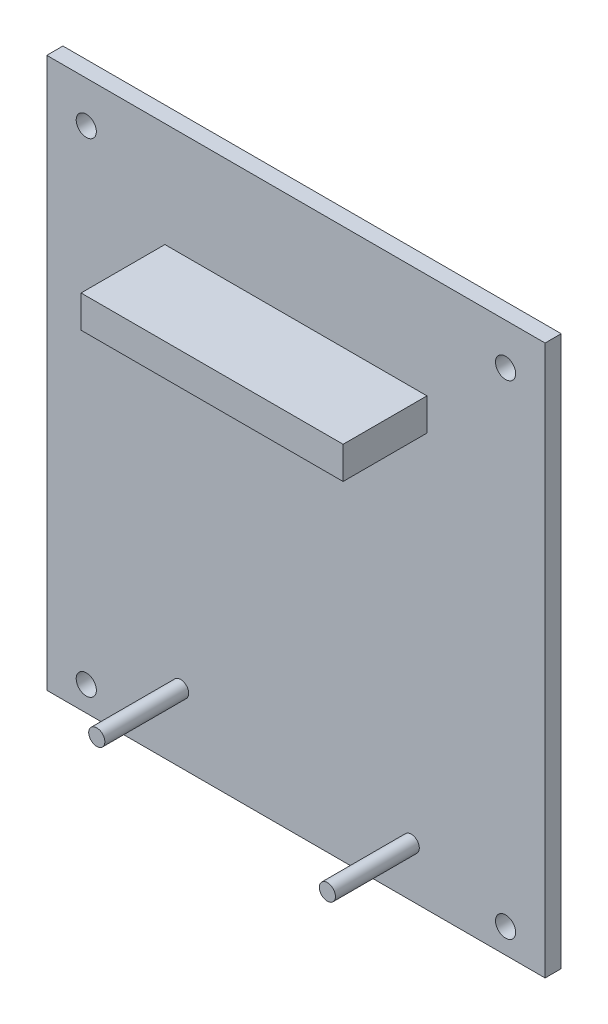
ISO-10303-21;
HEADER;
FILE_DESCRIPTION(('STEP AP214'),'2;1');
FILE_NAME('part.step','',(''),(''),'','','');
FILE_SCHEMA(('AUTOMOTIVE_DESIGN { 1 0 10303 214 1 1 1 1 }'));
ENDSEC;
DATA;
#1=APPLICATION_CONTEXT('core data for automotive mechanical design processes');
#2=APPLICATION_PROTOCOL_DEFINITION('international standard','automotive_design',2000,#1);
#3=PRODUCT_CONTEXT('',#1,'mechanical');
#4=PRODUCT('Part','Part','',(#3));
#5=PRODUCT_RELATED_PRODUCT_CATEGORY('part','',(#4));
#6=PRODUCT_DEFINITION_FORMATION('','',#4);
#7=PRODUCT_DEFINITION_CONTEXT('part definition',#1,'design');
#8=PRODUCT_DEFINITION('design','',#6,#7);
#9=PRODUCT_DEFINITION_SHAPE('','',#8);
#10=(LENGTH_UNIT() NAMED_UNIT(*) SI_UNIT(.MILLI.,.METRE.));
#11=(NAMED_UNIT(*) PLANE_ANGLE_UNIT() SI_UNIT($,.RADIAN.));
#12=(NAMED_UNIT(*) SI_UNIT($,.STERADIAN.) SOLID_ANGLE_UNIT());
#13=UNCERTAINTY_MEASURE_WITH_UNIT(LENGTH_MEASURE(1.E-05),#10,'distance_accuracy_value','');
#14=(GEOMETRIC_REPRESENTATION_CONTEXT(3) GLOBAL_UNCERTAINTY_ASSIGNED_CONTEXT((#13)) GLOBAL_UNIT_ASSIGNED_CONTEXT((#10,
#11,#12)) REPRESENTATION_CONTEXT('',''));
#15=CARTESIAN_POINT('',(0.,0.,0.));
#16=DIRECTION('',(0.,0.,1.));
#17=DIRECTION('',(1.,0.,0.));
#18=AXIS2_PLACEMENT_3D('',#15,#16,#17);
#19=CARTESIAN_POINT('',(0.,0.,2.54));
#20=DIRECTION('',(0.,0.,1.));
#21=DIRECTION('',(1.,0.,0.));
#22=AXIS2_PLACEMENT_3D('',#19,#20,#21);
#23=PLANE('',#22);
#24=CARTESIAN_POINT('',(57.404,7.8105,2.54));
#25=DIRECTION('',(0.,0.,1.));
#26=DIRECTION('',(1.,0.,0.));
#27=AXIS2_PLACEMENT_3D('',#24,#25,#26);
#28=CIRCLE('',#27,1.27);
#29=CARTESIAN_POINT('',(58.674,7.8105,2.54));
#30=VERTEX_POINT('',#29);
#31=EDGE_CURVE('E259',#30,#30,#28,.T.);
#32=ORIENTED_EDGE('',*,*,#31,.F.);
#33=EDGE_LOOP('',(#32));
#34=FACE_BOUND('',#33,.T.);
#35=CARTESIAN_POINT('',(21.082,10.7569,2.54));
#36=DIRECTION('',(0.,0.,1.));
#37=DIRECTION('',(1.,0.,0.));
#38=AXIS2_PLACEMENT_3D('',#35,#36,#37);
#39=CIRCLE('',#38,1.27);
#40=CARTESIAN_POINT('',(22.352,10.7569,2.54));
#41=VERTEX_POINT('',#40);
#42=EDGE_CURVE('E258',#41,#41,#39,.T.);
#43=ORIENTED_EDGE('',*,*,#42,.F.);
#44=EDGE_LOOP('',(#43));
#45=FACE_BOUND('',#44,.T.);
#46=CARTESIAN_POINT('',(72.263,3.91160000000003,2.54));
#47=DIRECTION('',(0.,0.,1.));
#48=DIRECTION('',(1.,0.,0.));
#49=AXIS2_PLACEMENT_3D('',#46,#47,#48);
#50=CIRCLE('',#49,1.58749999999999);
#51=CARTESIAN_POINT('',(73.8505,3.91160000000003,2.54));
#52=VERTEX_POINT('',#51);
#53=EDGE_CURVE('E142',#52,#52,#50,.T.);
#54=ORIENTED_EDGE('',*,*,#53,.F.);
#55=EDGE_LOOP('',(#54));
#56=FACE_BOUND('',#55,.T.);
#57=CARTESIAN_POINT('',(6.22299999999995,80.1116,2.54));
#58=DIRECTION('',(0.,0.,1.));
#59=DIRECTION('',(1.,0.,0.));
#60=AXIS2_PLACEMENT_3D('',#57,#58,#59);
#61=CIRCLE('',#60,1.58749999999999);
#62=CARTESIAN_POINT('',(7.81049999999995,80.1116,2.54));
#63=VERTEX_POINT('',#62);
#64=EDGE_CURVE('E154',#63,#63,#61,.T.);
#65=ORIENTED_EDGE('',*,*,#64,.F.);
#66=EDGE_LOOP('',(#65));
#67=FACE_BOUND('',#66,.T.);
#68=DIRECTION('',(0.,-1.,0.));
#69=VECTOR('',#68,1.);
#70=CARTESIAN_POINT('',(0.,86.614,2.54));
#71=LINE('',#70,#69);
#72=CARTESIAN_POINT('',(0.,86.614,2.54));
#73=VERTEX_POINT('',#72);
#74=CARTESIAN_POINT('',(0.,0.,2.54));
#75=VERTEX_POINT('',#74);
#76=EDGE_CURVE('E160',#73,#75,#71,.T.);
#77=ORIENTED_EDGE('',*,*,#76,.T.);
#78=DIRECTION('',(1.,0.,0.));
#79=VECTOR('',#78,1.);
#80=CARTESIAN_POINT('',(0.,0.,2.54));
#81=LINE('',#80,#79);
#82=CARTESIAN_POINT('',(78.486,0.,2.54));
#83=VERTEX_POINT('',#82);
#84=EDGE_CURVE('E84',#75,#83,#81,.T.);
#85=ORIENTED_EDGE('',*,*,#84,.T.);
#86=DIRECTION('',(0.,1.,0.));
#87=VECTOR('',#86,1.);
#88=CARTESIAN_POINT('',(78.486,86.614,2.54));
#89=LINE('',#88,#87);
#90=CARTESIAN_POINT('',(78.486,86.614,2.54));
#91=VERTEX_POINT('',#90);
#92=EDGE_CURVE('E163',#83,#91,#89,.T.);
#93=ORIENTED_EDGE('',*,*,#92,.T.);
#94=DIRECTION('',(-1.,0.,0.));
#95=VECTOR('',#94,1.);
#96=CARTESIAN_POINT('',(0.,86.614,2.54));
#97=LINE('',#96,#95);
#98=EDGE_CURVE('E56',#91,#73,#97,.T.);
#99=ORIENTED_EDGE('',*,*,#98,.T.);
#100=EDGE_LOOP('',(#77,#85,#93,#99));
#101=FACE_BOUND('',#100,.T.);
#102=CARTESIAN_POINT('',(72.2629999999999,80.1116,2.54));
#103=DIRECTION('',(0.,0.,1.));
#104=DIRECTION('',(1.,0.,0.));
#105=AXIS2_PLACEMENT_3D('',#102,#103,#104);
#106=CIRCLE('',#105,1.5875);
#107=CARTESIAN_POINT('',(73.8505,80.1116,2.54));
#108=VERTEX_POINT('',#107);
#109=EDGE_CURVE('E148',#108,#108,#106,.T.);
#110=ORIENTED_EDGE('',*,*,#109,.F.);
#111=EDGE_LOOP('',(#110));
#112=FACE_BOUND('',#111,.T.);
#113=CARTESIAN_POINT('',(6.223,3.91159999999997,2.54));
#114=DIRECTION('',(0.,0.,1.));
#115=DIRECTION('',(1.,0.,0.));
#116=AXIS2_PLACEMENT_3D('',#113,#114,#115);
#117=CIRCLE('',#116,1.58749999999999);
#118=CARTESIAN_POINT('',(7.8105,3.91159999999997,2.54));
#119=VERTEX_POINT('',#118);
#120=EDGE_CURVE('E134',#119,#119,#117,.T.);
#121=ORIENTED_EDGE('',*,*,#120,.F.);
#122=EDGE_LOOP('',(#121));
#123=FACE_BOUND('',#122,.T.);
#124=DIRECTION('',(1.,0.,0.));
#125=VECTOR('',#124,1.);
#126=CARTESIAN_POINT('',(18.6055,65.0239999999999,2.54));
#127=LINE('',#126,#125);
#128=CARTESIAN_POINT('',(18.6055,65.0239999999999,2.54));
#129=VERTEX_POINT('',#128);
#130=CARTESIAN_POINT('',(59.8805,65.024,2.54));
#131=VERTEX_POINT('',#130);
#132=EDGE_CURVE('E273',#129,#131,#127,.T.);
#133=ORIENTED_EDGE('',*,*,#132,.F.);
#134=DIRECTION('',(0.,-1.,0.));
#135=VECTOR('',#134,1.);
#136=CARTESIAN_POINT('',(18.6055,70.104,2.54));
#137=LINE('',#136,#135);
#138=CARTESIAN_POINT('',(18.6055,70.104,2.54));
#139=VERTEX_POINT('',#138);
#140=EDGE_CURVE('E129',#139,#129,#137,.T.);
#141=ORIENTED_EDGE('',*,*,#140,.F.);
#142=DIRECTION('',(-1.,0.,0.));
#143=VECTOR('',#142,1.);
#144=CARTESIAN_POINT('',(18.6055,70.104,2.54));
#145=LINE('',#144,#143);
#146=CARTESIAN_POINT('',(59.8805,70.104,2.54));
#147=VERTEX_POINT('',#146);
#148=EDGE_CURVE('E125',#147,#139,#145,.T.);
#149=ORIENTED_EDGE('',*,*,#148,.F.);
#150=DIRECTION('',(0.,1.,0.));
#151=VECTOR('',#150,1.);
#152=CARTESIAN_POINT('',(59.8805,70.104,2.54));
#153=LINE('',#152,#151);
#154=EDGE_CURVE('E275',#131,#147,#153,.T.);
#155=ORIENTED_EDGE('',*,*,#154,.F.);
#156=EDGE_LOOP('',(#133,#141,#149,#155));
#157=FACE_BOUND('',#156,.T.);
#158=ADVANCED_FACE('F32',(#34,#45,#56,#67,#101,#112,#123,#157),#23,.T.);
#159=CARTESIAN_POINT('',(0.,0.,0.));
#160=DIRECTION('',(0.,0.,1.));
#161=DIRECTION('',(1.,0.,0.));
#162=AXIS2_PLACEMENT_3D('',#159,#160,#161);
#163=PLANE('',#162);
#164=DIRECTION('',(0.,-1.,0.));
#165=VECTOR('',#164,1.);
#166=CARTESIAN_POINT('',(0.,86.614,0.));
#167=LINE('',#166,#165);
#168=CARTESIAN_POINT('',(0.,86.614,0.));
#169=VERTEX_POINT('',#168);
#170=CARTESIAN_POINT('',(0.,0.,0.));
#171=VERTEX_POINT('',#170);
#172=EDGE_CURVE('E157',#169,#171,#167,.T.);
#173=ORIENTED_EDGE('',*,*,#172,.F.);
#174=DIRECTION('',(-1.,0.,0.));
#175=VECTOR('',#174,1.);
#176=CARTESIAN_POINT('',(0.,86.614,0.));
#177=LINE('',#176,#175);
#178=CARTESIAN_POINT('',(78.486,86.614,0.));
#179=VERTEX_POINT('',#178);
#180=EDGE_CURVE('E77',#179,#169,#177,.T.);
#181=ORIENTED_EDGE('',*,*,#180,.F.);
#182=DIRECTION('',(0.,1.,0.));
#183=VECTOR('',#182,1.);
#184=CARTESIAN_POINT('',(78.486,86.614,0.));
#185=LINE('',#184,#183);
#186=CARTESIAN_POINT('',(78.486,0.,0.));
#187=VERTEX_POINT('',#186);
#188=EDGE_CURVE('E171',#187,#179,#185,.T.);
#189=ORIENTED_EDGE('',*,*,#188,.F.);
#190=DIRECTION('',(1.,0.,0.));
#191=VECTOR('',#190,1.);
#192=CARTESIAN_POINT('',(0.,0.,0.));
#193=LINE('',#192,#191);
#194=EDGE_CURVE('E169',#171,#187,#193,.T.);
#195=ORIENTED_EDGE('',*,*,#194,.F.);
#196=EDGE_LOOP('',(#173,#181,#189,#195));
#197=FACE_BOUND('',#196,.T.);
#198=CARTESIAN_POINT('',(6.22299999999995,80.1116,0.));
#199=DIRECTION('',(0.,0.,1.));
#200=DIRECTION('',(1.,0.,0.));
#201=AXIS2_PLACEMENT_3D('',#198,#199,#200);
#202=CIRCLE('',#201,1.58749999999999);
#203=CARTESIAN_POINT('',(7.81049999999995,80.1116,0.));
#204=VERTEX_POINT('',#203);
#205=EDGE_CURVE('E151',#204,#204,#202,.T.);
#206=ORIENTED_EDGE('',*,*,#205,.T.);
#207=EDGE_LOOP('',(#206));
#208=FACE_BOUND('',#207,.T.);
#209=CARTESIAN_POINT('',(72.2629999999999,80.1116,0.));
#210=DIRECTION('',(0.,0.,1.));
#211=DIRECTION('',(1.,0.,0.));
#212=AXIS2_PLACEMENT_3D('',#209,#210,#211);
#213=CIRCLE('',#212,1.5875);
#214=CARTESIAN_POINT('',(73.8505,80.1116,0.));
#215=VERTEX_POINT('',#214);
#216=EDGE_CURVE('E145',#215,#215,#213,.T.);
#217=ORIENTED_EDGE('',*,*,#216,.T.);
#218=EDGE_LOOP('',(#217));
#219=FACE_BOUND('',#218,.T.);
#220=CARTESIAN_POINT('',(72.263,3.91160000000003,0.));
#221=DIRECTION('',(0.,0.,1.));
#222=DIRECTION('',(1.,0.,0.));
#223=AXIS2_PLACEMENT_3D('',#220,#221,#222);
#224=CIRCLE('',#223,1.58749999999999);
#225=CARTESIAN_POINT('',(73.8505,3.91160000000003,0.));
#226=VERTEX_POINT('',#225);
#227=EDGE_CURVE('E140',#226,#226,#224,.T.);
#228=ORIENTED_EDGE('',*,*,#227,.T.);
#229=EDGE_LOOP('',(#228));
#230=FACE_BOUND('',#229,.T.);
#231=CARTESIAN_POINT('',(6.223,3.91159999999997,0.));
#232=DIRECTION('',(0.,0.,1.));
#233=DIRECTION('',(1.,0.,0.));
#234=AXIS2_PLACEMENT_3D('',#231,#232,#233);
#235=CIRCLE('',#234,1.58749999999999);
#236=CARTESIAN_POINT('',(7.8105,3.91159999999997,0.));
#237=VERTEX_POINT('',#236);
#238=EDGE_CURVE('E131',#237,#237,#235,.T.);
#239=ORIENTED_EDGE('',*,*,#238,.T.);
#240=EDGE_LOOP('',(#239));
#241=FACE_BOUND('',#240,.T.);
#242=ADVANCED_FACE('F184',(#197,#208,#219,#230,#241),#163,.F.);
#243=CARTESIAN_POINT('',(0.,86.614,2.54));
#244=DIRECTION('',(1.,0.,0.));
#245=DIRECTION('',(0.,1.,0.));
#246=AXIS2_PLACEMENT_3D('',#243,#244,#245);
#247=PLANE('',#246);
#248=ORIENTED_EDGE('',*,*,#172,.T.);
#249=DIRECTION('',(0.,0.,-1.));
#250=VECTOR('',#249,1.);
#251=CARTESIAN_POINT('',(0.,0.,2.54));
#252=LINE('',#251,#250);
#253=EDGE_CURVE('E11',#75,#171,#252,.T.);
#254=ORIENTED_EDGE('',*,*,#253,.F.);
#255=ORIENTED_EDGE('',*,*,#76,.F.);
#256=DIRECTION('',(0.,0.,-1.));
#257=VECTOR('',#256,1.);
#258=CARTESIAN_POINT('',(0.,86.614,2.54));
#259=LINE('',#258,#257);
#260=EDGE_CURVE('E166',#73,#169,#259,.T.);
#261=ORIENTED_EDGE('',*,*,#260,.T.);
#262=EDGE_LOOP('',(#248,#254,#255,#261));
#263=FACE_BOUND('',#262,.T.);
#264=ADVANCED_FACE('F34',(#263),#247,.F.);
#265=CARTESIAN_POINT('',(0.,0.,2.54));
#266=DIRECTION('',(0.,1.,0.));
#267=DIRECTION('',(-1.,0.,0.));
#268=AXIS2_PLACEMENT_3D('',#265,#266,#267);
#269=PLANE('',#268);
#270=ORIENTED_EDGE('',*,*,#194,.T.);
#271=DIRECTION('',(0.,0.,-1.));
#272=VECTOR('',#271,1.);
#273=CARTESIAN_POINT('',(78.486,0.,2.54));
#274=LINE('',#273,#272);
#275=EDGE_CURVE('E40',#83,#187,#274,.T.);
#276=ORIENTED_EDGE('',*,*,#275,.F.);
#277=ORIENTED_EDGE('',*,*,#84,.F.);
#278=ORIENTED_EDGE('',*,*,#253,.T.);
#279=EDGE_LOOP('',(#270,#276,#277,#278));
#280=FACE_BOUND('',#279,.T.);
#281=ADVANCED_FACE('F200',(#280),#269,.F.);
#282=CARTESIAN_POINT('',(78.486,86.614,2.54));
#283=DIRECTION('',(-1.,0.,0.));
#284=DIRECTION('',(0.,-1.,0.));
#285=AXIS2_PLACEMENT_3D('',#282,#283,#284);
#286=PLANE('',#285);
#287=ORIENTED_EDGE('',*,*,#188,.T.);
#288=DIRECTION('',(0.,0.,-1.));
#289=VECTOR('',#288,1.);
#290=CARTESIAN_POINT('',(78.486,86.614,2.54));
#291=LINE('',#290,#289);
#292=EDGE_CURVE('E175',#91,#179,#291,.T.);
#293=ORIENTED_EDGE('',*,*,#292,.F.);
#294=ORIENTED_EDGE('',*,*,#92,.F.);
#295=ORIENTED_EDGE('',*,*,#275,.T.);
#296=EDGE_LOOP('',(#287,#293,#294,#295));
#297=FACE_BOUND('',#296,.T.);
#298=ADVANCED_FACE('F180',(#297),#286,.F.);
#299=CARTESIAN_POINT('',(0.,86.614,2.54));
#300=DIRECTION('',(0.,-1.,0.));
#301=DIRECTION('',(1.,0.,0.));
#302=AXIS2_PLACEMENT_3D('',#299,#300,#301);
#303=PLANE('',#302);
#304=ORIENTED_EDGE('',*,*,#180,.T.);
#305=ORIENTED_EDGE('',*,*,#260,.F.);
#306=ORIENTED_EDGE('',*,*,#98,.F.);
#307=ORIENTED_EDGE('',*,*,#292,.T.);
#308=EDGE_LOOP('',(#304,#305,#306,#307));
#309=FACE_BOUND('',#308,.T.);
#310=ADVANCED_FACE('F189',(#309),#303,.F.);
#311=CARTESIAN_POINT('',(6.22299999999995,80.1116,2.54));
#312=DIRECTION('',(0.,0.,-1.));
#313=DIRECTION('',(-1.,0.,0.));
#314=AXIS2_PLACEMENT_3D('',#311,#312,#313);
#315=CYLINDRICAL_SURFACE('',#314,1.58749999999999);
#316=ORIENTED_EDGE('',*,*,#64,.T.);
#317=EDGE_LOOP('',(#316));
#318=FACE_BOUND('',#317,.T.);
#319=ORIENTED_EDGE('',*,*,#205,.F.);
#320=EDGE_LOOP('',(#319));
#321=FACE_BOUND('',#320,.T.);
#322=ADVANCED_FACE('F191',(#318,#321),#315,.F.);
#323=CARTESIAN_POINT('',(72.2629999999999,80.1116,2.54));
#324=DIRECTION('',(0.,0.,-1.));
#325=DIRECTION('',(-1.,0.,0.));
#326=AXIS2_PLACEMENT_3D('',#323,#324,#325);
#327=CYLINDRICAL_SURFACE('',#326,1.5875);
#328=ORIENTED_EDGE('',*,*,#109,.T.);
#329=EDGE_LOOP('',(#328));
#330=FACE_BOUND('',#329,.T.);
#331=ORIENTED_EDGE('',*,*,#216,.F.);
#332=EDGE_LOOP('',(#331));
#333=FACE_BOUND('',#332,.T.);
#334=ADVANCED_FACE('F197',(#330,#333),#327,.F.);
#335=CARTESIAN_POINT('',(72.263,3.91160000000003,2.54));
#336=DIRECTION('',(0.,0.,-1.));
#337=DIRECTION('',(-1.,0.,0.));
#338=AXIS2_PLACEMENT_3D('',#335,#336,#337);
#339=CYLINDRICAL_SURFACE('',#338,1.58749999999999);
#340=ORIENTED_EDGE('',*,*,#53,.T.);
#341=EDGE_LOOP('',(#340));
#342=FACE_BOUND('',#341,.T.);
#343=ORIENTED_EDGE('',*,*,#227,.F.);
#344=EDGE_LOOP('',(#343));
#345=FACE_BOUND('',#344,.T.);
#346=ADVANCED_FACE('F216',(#342,#345),#339,.F.);
#347=CARTESIAN_POINT('',(6.223,3.91159999999997,2.54));
#348=DIRECTION('',(0.,0.,-1.));
#349=DIRECTION('',(-1.,0.,0.));
#350=AXIS2_PLACEMENT_3D('',#347,#348,#349);
#351=CYLINDRICAL_SURFACE('',#350,1.58749999999999);
#352=ORIENTED_EDGE('',*,*,#120,.T.);
#353=EDGE_LOOP('',(#352));
#354=FACE_BOUND('',#353,.T.);
#355=ORIENTED_EDGE('',*,*,#238,.F.);
#356=EDGE_LOOP('',(#355));
#357=FACE_BOUND('',#356,.T.);
#358=ADVANCED_FACE('F220',(#354,#357),#351,.F.);
#359=CARTESIAN_POINT('',(18.6055,70.104,15.748));
#360=DIRECTION('',(1.,0.,0.));
#361=DIRECTION('',(0.,0.,-1.));
#362=AXIS2_PLACEMENT_3D('',#359,#360,#361);
#363=PLANE('',#362);
#364=ORIENTED_EDGE('',*,*,#140,.T.);
#365=DIRECTION('',(0.,0.,-1.));
#366=VECTOR('',#365,1.);
#367=CARTESIAN_POINT('',(18.6055,65.0239999999999,15.748));
#368=LINE('',#367,#366);
#369=CARTESIAN_POINT('',(18.6055,65.0239999999999,15.748));
#370=VERTEX_POINT('',#369);
#371=EDGE_CURVE('E110',#370,#129,#368,.T.);
#372=ORIENTED_EDGE('',*,*,#371,.F.);
#373=DIRECTION('',(0.,-1.,0.));
#374=VECTOR('',#373,1.);
#375=CARTESIAN_POINT('',(18.6055,70.104,15.748));
#376=LINE('',#375,#374);
#377=CARTESIAN_POINT('',(18.6055,70.104,15.748));
#378=VERTEX_POINT('',#377);
#379=EDGE_CURVE('E117',#378,#370,#376,.T.);
#380=ORIENTED_EDGE('',*,*,#379,.F.);
#381=DIRECTION('',(0.,0.,-1.));
#382=VECTOR('',#381,1.);
#383=CARTESIAN_POINT('',(18.6055,70.104,15.748));
#384=LINE('',#383,#382);
#385=EDGE_CURVE('E271',#378,#139,#384,.T.);
#386=ORIENTED_EDGE('',*,*,#385,.T.);
#387=EDGE_LOOP('',(#364,#372,#380,#386));
#388=FACE_BOUND('',#387,.T.);
#389=ADVANCED_FACE('F127',(#388),#363,.F.);
#390=CARTESIAN_POINT('',(18.6055,65.0239999999999,15.748));
#391=DIRECTION('',(0.,1.,0.));
#392=DIRECTION('',(-1.,0.,0.));
#393=AXIS2_PLACEMENT_3D('',#390,#391,#392);
#394=PLANE('',#393);
#395=ORIENTED_EDGE('',*,*,#132,.T.);
#396=DIRECTION('',(0.,0.,-1.));
#397=VECTOR('',#396,1.);
#398=CARTESIAN_POINT('',(59.8805,65.024,15.748));
#399=LINE('',#398,#397);
#400=CARTESIAN_POINT('',(59.8805,65.024,15.748));
#401=VERTEX_POINT('',#400);
#402=EDGE_CURVE('E113',#401,#131,#399,.T.);
#403=ORIENTED_EDGE('',*,*,#402,.F.);
#404=DIRECTION('',(1.,0.,0.));
#405=VECTOR('',#404,1.);
#406=CARTESIAN_POINT('',(18.6055,65.0239999999999,15.748));
#407=LINE('',#406,#405);
#408=EDGE_CURVE('E106',#370,#401,#407,.T.);
#409=ORIENTED_EDGE('',*,*,#408,.F.);
#410=ORIENTED_EDGE('',*,*,#371,.T.);
#411=EDGE_LOOP('',(#395,#403,#409,#410));
#412=FACE_BOUND('',#411,.T.);
#413=ADVANCED_FACE('F108',(#412),#394,.F.);
#414=CARTESIAN_POINT('',(59.8805,70.104,15.748));
#415=DIRECTION('',(-1.,0.,0.));
#416=DIRECTION('',(0.,-1.,0.));
#417=AXIS2_PLACEMENT_3D('',#414,#415,#416);
#418=PLANE('',#417);
#419=ORIENTED_EDGE('',*,*,#154,.T.);
#420=DIRECTION('',(0.,0.,-1.));
#421=VECTOR('',#420,1.);
#422=CARTESIAN_POINT('',(59.8805,70.104,15.748));
#423=LINE('',#422,#421);
#424=CARTESIAN_POINT('',(59.8805,70.104,15.748));
#425=VERTEX_POINT('',#424);
#426=EDGE_CURVE('E47',#425,#147,#423,.T.);
#427=ORIENTED_EDGE('',*,*,#426,.F.);
#428=DIRECTION('',(0.,1.,0.));
#429=VECTOR('',#428,1.);
#430=CARTESIAN_POINT('',(59.8805,70.104,15.748));
#431=LINE('',#430,#429);
#432=EDGE_CURVE('E116',#401,#425,#431,.T.);
#433=ORIENTED_EDGE('',*,*,#432,.F.);
#434=ORIENTED_EDGE('',*,*,#402,.T.);
#435=EDGE_LOOP('',(#419,#427,#433,#434));
#436=FACE_BOUND('',#435,.T.);
#437=ADVANCED_FACE('F229',(#436),#418,.F.);
#438=CARTESIAN_POINT('',(18.6055,70.104,15.748));
#439=DIRECTION('',(0.,-1.,0.));
#440=DIRECTION('',(1.,0.,0.));
#441=AXIS2_PLACEMENT_3D('',#438,#439,#440);
#442=PLANE('',#441);
#443=ORIENTED_EDGE('',*,*,#148,.T.);
#444=ORIENTED_EDGE('',*,*,#385,.F.);
#445=DIRECTION('',(-1.,0.,0.));
#446=VECTOR('',#445,1.);
#447=CARTESIAN_POINT('',(18.6055,70.104,15.748));
#448=LINE('',#447,#446);
#449=EDGE_CURVE('E121',#425,#378,#448,.T.);
#450=ORIENTED_EDGE('',*,*,#449,.F.);
#451=ORIENTED_EDGE('',*,*,#426,.T.);
#452=EDGE_LOOP('',(#443,#444,#450,#451));
#453=FACE_BOUND('',#452,.T.);
#454=ADVANCED_FACE('F232',(#453),#442,.F.);
#455=CARTESIAN_POINT('',(0.,0.,15.748));
#456=DIRECTION('',(0.,0.,1.));
#457=DIRECTION('',(1.,0.,0.));
#458=AXIS2_PLACEMENT_3D('',#455,#456,#457);
#459=PLANE('',#458);
#460=ORIENTED_EDGE('',*,*,#379,.T.);
#461=ORIENTED_EDGE('',*,*,#408,.T.);
#462=ORIENTED_EDGE('',*,*,#432,.T.);
#463=ORIENTED_EDGE('',*,*,#449,.T.);
#464=EDGE_LOOP('',(#460,#461,#462,#463));
#465=FACE_BOUND('',#464,.T.);
#466=ADVANCED_FACE('F120',(#465),#459,.T.);
#467=CARTESIAN_POINT('',(21.082,10.7569,15.748));
#468=DIRECTION('',(0.,0.,-1.));
#469=DIRECTION('',(-1.,0.,0.));
#470=AXIS2_PLACEMENT_3D('',#467,#468,#469);
#471=CYLINDRICAL_SURFACE('',#470,1.27);
#472=CARTESIAN_POINT('',(21.082,10.7569,15.748));
#473=DIRECTION('',(0.,0.,1.));
#474=DIRECTION('',(1.,0.,0.));
#475=AXIS2_PLACEMENT_3D('',#472,#473,#474);
#476=CIRCLE('',#475,1.27);
#477=CARTESIAN_POINT('',(22.352,10.7569,15.748));
#478=VERTEX_POINT('',#477);
#479=EDGE_CURVE('E262',#478,#478,#476,.T.);
#480=ORIENTED_EDGE('',*,*,#479,.F.);
#481=EDGE_LOOP('',(#480));
#482=FACE_BOUND('',#481,.T.);
#483=ORIENTED_EDGE('',*,*,#42,.T.);
#484=EDGE_LOOP('',(#483));
#485=FACE_BOUND('',#484,.T.);
#486=ADVANCED_FACE('F238',(#482,#485),#471,.T.);
#487=CARTESIAN_POINT('',(21.082,10.7569,15.748));
#488=DIRECTION('',(0.,0.,1.));
#489=DIRECTION('',(1.,0.,0.));
#490=AXIS2_PLACEMENT_3D('',#487,#488,#489);
#491=PLANE('',#490);
#492=ORIENTED_EDGE('',*,*,#479,.T.);
#493=EDGE_LOOP('',(#492));
#494=FACE_BOUND('',#493,.T.);
#495=ADVANCED_FACE('F241',(#494),#491,.T.);
#496=CARTESIAN_POINT('',(57.404,7.8105,15.748));
#497=DIRECTION('',(0.,0.,-1.));
#498=DIRECTION('',(-1.,0.,0.));
#499=AXIS2_PLACEMENT_3D('',#496,#497,#498);
#500=CYLINDRICAL_SURFACE('',#499,1.27);
#501=CARTESIAN_POINT('',(57.404,7.8105,15.748));
#502=DIRECTION('',(0.,0.,1.));
#503=DIRECTION('',(1.,0.,0.));
#504=AXIS2_PLACEMENT_3D('',#501,#502,#503);
#505=CIRCLE('',#504,1.27);
#506=CARTESIAN_POINT('',(58.674,7.8105,15.748));
#507=VERTEX_POINT('',#506);
#508=EDGE_CURVE('E257',#507,#507,#505,.T.);
#509=ORIENTED_EDGE('',*,*,#508,.F.);
#510=EDGE_LOOP('',(#509));
#511=FACE_BOUND('',#510,.T.);
#512=ORIENTED_EDGE('',*,*,#31,.T.);
#513=EDGE_LOOP('',(#512));
#514=FACE_BOUND('',#513,.T.);
#515=ADVANCED_FACE('F245',(#511,#514),#500,.T.);
#516=CARTESIAN_POINT('',(57.404,7.8105,15.748));
#517=DIRECTION('',(0.,0.,1.));
#518=DIRECTION('',(1.,0.,0.));
#519=AXIS2_PLACEMENT_3D('',#516,#517,#518);
#520=PLANE('',#519);
#521=ORIENTED_EDGE('',*,*,#508,.T.);
#522=EDGE_LOOP('',(#521));
#523=FACE_BOUND('',#522,.T.);
#524=ADVANCED_FACE('F249',(#523),#520,.T.);
#525=CLOSED_SHELL('',(#158,#242,#264,#281,#298,#310,#322,#334,#346,#358,#389,#413,#437,#454,
#466,#486,#495,#515,#524));
#526=MANIFOLD_SOLID_BREP('B2',#525);
#527=ADVANCED_BREP_SHAPE_REPRESENTATION('',(#18,#526),#14);
#528=SHAPE_DEFINITION_REPRESENTATION(#9,#527);
ENDSEC;
END-ISO-10303-21;
